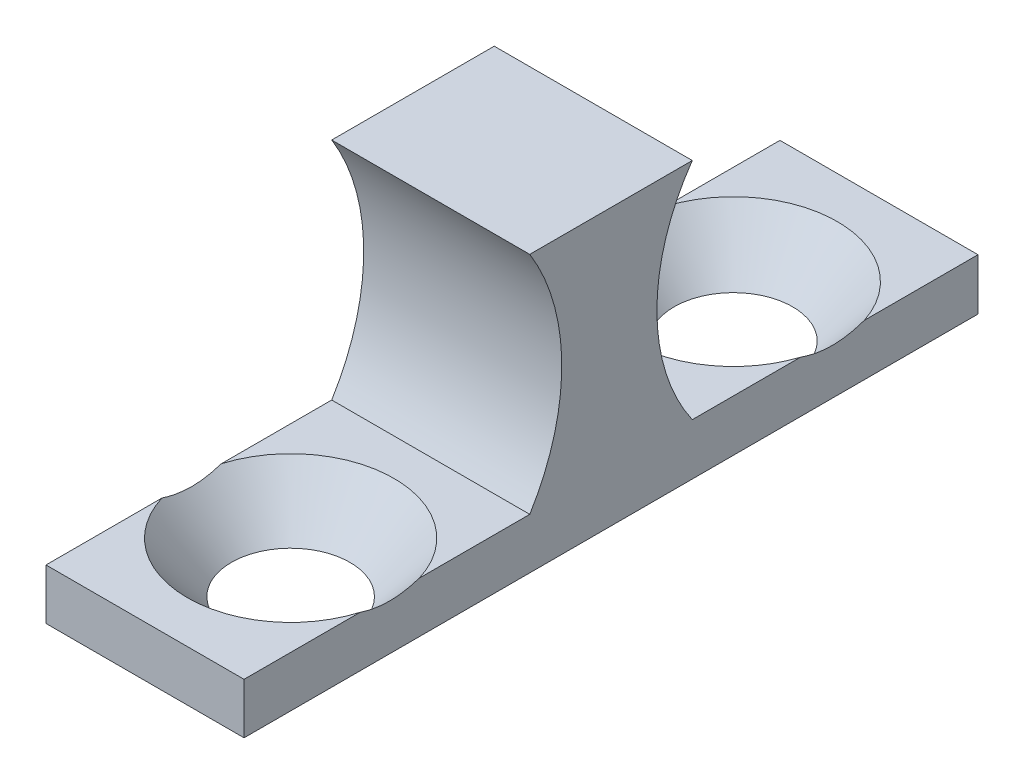
ISO-10303-21;
HEADER;
FILE_DESCRIPTION(('STEP AP214'),'2;1');
FILE_NAME('part.step','',(''),(''),'','','');
FILE_SCHEMA(('AUTOMOTIVE_DESIGN { 1 0 10303 214 1 1 1 1 }'));
ENDSEC;
DATA;
#1=APPLICATION_CONTEXT('core data for automotive mechanical design processes');
#2=APPLICATION_PROTOCOL_DEFINITION('international standard','automotive_design',2000,#1);
#3=PRODUCT_CONTEXT('',#1,'mechanical');
#4=PRODUCT('Part','Part','',(#3));
#5=PRODUCT_RELATED_PRODUCT_CATEGORY('part','',(#4));
#6=PRODUCT_DEFINITION_FORMATION('','',#4);
#7=PRODUCT_DEFINITION_CONTEXT('part definition',#1,'design');
#8=PRODUCT_DEFINITION('design','',#6,#7);
#9=PRODUCT_DEFINITION_SHAPE('','',#8);
#10=(LENGTH_UNIT() NAMED_UNIT(*) SI_UNIT(.MILLI.,.METRE.));
#11=(NAMED_UNIT(*) PLANE_ANGLE_UNIT() SI_UNIT($,.RADIAN.));
#12=(NAMED_UNIT(*) SI_UNIT($,.STERADIAN.) SOLID_ANGLE_UNIT());
#13=UNCERTAINTY_MEASURE_WITH_UNIT(LENGTH_MEASURE(1.E-05),#10,'distance_accuracy_value','');
#14=(GEOMETRIC_REPRESENTATION_CONTEXT(3) GLOBAL_UNCERTAINTY_ASSIGNED_CONTEXT((#13)) GLOBAL_UNIT_ASSIGNED_CONTEXT((#10,
#11,#12)) REPRESENTATION_CONTEXT('',''));
#15=CARTESIAN_POINT('',(0.,0.,0.));
#16=DIRECTION('',(0.,0.,1.));
#17=DIRECTION('',(1.,0.,0.));
#18=AXIS2_PLACEMENT_3D('',#15,#16,#17);
#19=CARTESIAN_POINT('',(6.746875,1.62001456764937,-3.48806378292971));
#20=DIRECTION('',(0.,-1.,0.));
#21=DIRECTION('',(0.,0.,-1.));
#22=AXIS2_PLACEMENT_3D('',#19,#20,#21);
#23=PLANE('',#22);
#24=DIRECTION('',(0.,0.,1.));
#25=VECTOR('',#24,1.);
#26=CARTESIAN_POINT('',(6.746875,1.62001456764937,-3.48806378292971));
#27=LINE('',#26,#25);
#28=CARTESIAN_POINT('',(6.746875,1.62001456764937,-7.17205555422858));
#29=VERTEX_POINT('',#28);
#30=CARTESIAN_POINT('',(6.746875,1.62001456764937,-3.48806378292971));
#31=VERTEX_POINT('',#30);
#32=EDGE_CURVE('E136',#29,#31,#27,.T.);
#33=ORIENTED_EDGE('',*,*,#32,.F.);
#34=CARTESIAN_POINT('',(3.3747601467896,1.62001456764937,-8.26008878292972));
#35=DIRECTION('',(0.,1.,0.));
#36=DIRECTION('',(0.,0.,1.));
#37=AXIS2_PLACEMENT_3D('',#34,#35,#36);
#38=CIRCLE('',#37,3.5433);
#39=CARTESIAN_POINT('',(0.,1.62001456764937,-7.18028841173112));
#40=VERTEX_POINT('',#39);
#41=EDGE_CURVE('E123',#40,#29,#38,.T.);
#42=ORIENTED_EDGE('',*,*,#41,.F.);
#43=DIRECTION('',(0.,0.,1.));
#44=VECTOR('',#43,1.);
#45=CARTESIAN_POINT('',(0.,1.62001456764937,-3.48806378292971));
#46=LINE('',#45,#44);
#47=CARTESIAN_POINT('',(0.,1.62001456764937,-3.48806378292971));
#48=VERTEX_POINT('',#47);
#49=EDGE_CURVE('E167',#40,#48,#46,.T.);
#50=ORIENTED_EDGE('',*,*,#49,.T.);
#51=DIRECTION('',(-1.,0.,0.));
#52=VECTOR('',#51,1.);
#53=CARTESIAN_POINT('',(6.746875,1.62001456764937,-3.48806378292971));
#54=LINE('',#53,#52);
#55=EDGE_CURVE('E144',#31,#48,#54,.T.);
#56=ORIENTED_EDGE('',*,*,#55,.F.);
#57=EDGE_LOOP('',(#33,#42,#50,#56));
#58=FACE_BOUND('',#57,.T.);
#59=ADVANCED_FACE('F32',(#58),#23,.F.);
#60=CARTESIAN_POINT('',(6.746875,1.59461456764937,2.04913621707029));
#61=DIRECTION('',(0.,-1.,0.));
#62=DIRECTION('',(0.,0.,-1.));
#63=AXIS2_PLACEMENT_3D('',#60,#61,#62);
#64=PLANE('',#63);
#65=DIRECTION('',(0.,0.,1.));
#66=VECTOR('',#65,1.);
#67=CARTESIAN_POINT('',(6.746875,1.59461456764937,2.04913621707029));
#68=LINE('',#67,#66);
#69=CARTESIAN_POINT('',(6.746875,1.59461456764937,7.83057214819792));
#70=VERTEX_POINT('',#69);
#71=CARTESIAN_POINT('',(6.746875,1.59461456764937,11.7820987170703));
#72=VERTEX_POINT('',#71);
#73=EDGE_CURVE('E154',#70,#72,#68,.T.);
#74=ORIENTED_EDGE('',*,*,#73,.F.);
#75=CARTESIAN_POINT('',(3.3734375,1.59461456764937,6.82116115907129));
#76=DIRECTION('',(0.,-1.,0.));
#77=DIRECTION('',(0.,0.,-1.));
#78=AXIS2_PLACEMENT_3D('',#75,#76,#77);
#79=CIRCLE('',#78,3.52122011685947);
#80=CARTESIAN_POINT('',(0.,1.59461456764937,7.83057214819791));
#81=VERTEX_POINT('',#80);
#82=EDGE_CURVE('E250',#70,#81,#79,.T.);
#83=ORIENTED_EDGE('',*,*,#82,.T.);
#84=DIRECTION('',(0.,0.,1.));
#85=VECTOR('',#84,1.);
#86=CARTESIAN_POINT('',(0.,1.59461456764937,2.04913621707029));
#87=LINE('',#86,#85);
#88=CARTESIAN_POINT('',(0.,1.59461456764937,11.7820987170703));
#89=VERTEX_POINT('',#88);
#90=EDGE_CURVE('E174',#81,#89,#87,.T.);
#91=ORIENTED_EDGE('',*,*,#90,.T.);
#92=DIRECTION('',(-1.,0.,0.));
#93=VECTOR('',#92,1.);
#94=CARTESIAN_POINT('',(6.746875,1.59461456764937,11.7820987170703));
#95=LINE('',#94,#93);
#96=EDGE_CURVE('E158',#72,#89,#95,.T.);
#97=ORIENTED_EDGE('',*,*,#96,.F.);
#98=EDGE_LOOP('',(#74,#83,#91,#97));
#99=FACE_BOUND('',#98,.T.);
#100=ADVANCED_FACE('F220',(#99),#64,.F.);
#101=CARTESIAN_POINT('',(6.746875,1.59461456764937,11.7820987170703));
#102=DIRECTION('',(0.,0.,-1.));
#103=DIRECTION('',(-1.,0.,0.));
#104=AXIS2_PLACEMENT_3D('',#101,#102,#103);
#105=PLANE('',#104);
#106=DIRECTION('',(0.,-1.,0.));
#107=VECTOR('',#106,1.);
#108=CARTESIAN_POINT('',(0.,1.59461456764937,11.7820987170703));
#109=LINE('',#108,#107);
#110=CARTESIAN_POINT('',(0.,-0.132585432350632,11.7820987170703));
#111=VERTEX_POINT('',#110);
#112=EDGE_CURVE('E159',#89,#111,#109,.T.);
#113=ORIENTED_EDGE('',*,*,#112,.T.);
#114=DIRECTION('',(-1.,0.,0.));
#115=VECTOR('',#114,1.);
#116=CARTESIAN_POINT('',(6.746875,-0.132585432350632,11.7820987170703));
#117=LINE('',#116,#115);
#118=CARTESIAN_POINT('',(6.746875,-0.132585432350632,11.7820987170703));
#119=VERTEX_POINT('',#118);
#120=EDGE_CURVE('E196',#119,#111,#117,.T.);
#121=ORIENTED_EDGE('',*,*,#120,.F.);
#122=DIRECTION('',(0.,-1.,0.));
#123=VECTOR('',#122,1.);
#124=CARTESIAN_POINT('',(6.746875,1.59461456764937,11.7820987170703));
#125=LINE('',#124,#123);
#126=EDGE_CURVE('E178',#72,#119,#125,.T.);
#127=ORIENTED_EDGE('',*,*,#126,.F.);
#128=ORIENTED_EDGE('',*,*,#96,.T.);
#129=EDGE_LOOP('',(#113,#121,#127,#128));
#130=FACE_BOUND('',#129,.T.);
#131=ADVANCED_FACE('F34',(#130),#105,.F.);
#132=CARTESIAN_POINT('',(6.746875,-0.132585432350632,11.7820987170703));
#133=DIRECTION('',(0.,1.,0.));
#134=DIRECTION('',(0.,0.,1.));
#135=AXIS2_PLACEMENT_3D('',#132,#133,#134);
#136=PLANE('',#135);
#137=CARTESIAN_POINT('',(3.3747601467896,-0.132585432350628,-8.26008878292972));
#138=DIRECTION('',(0.,1.,0.));
#139=DIRECTION('',(0.,0.,1.));
#140=AXIS2_PLACEMENT_3D('',#137,#138,#139);
#141=CIRCLE('',#140,2.01978806330328);
#142=CARTESIAN_POINT('',(3.3747601467896,-0.132585432350628,-6.24030071962644));
#143=VERTEX_POINT('',#142);
#144=EDGE_CURVE('E140',#143,#143,#141,.T.);
#145=ORIENTED_EDGE('',*,*,#144,.T.);
#146=EDGE_LOOP('',(#145));
#147=FACE_BOUND('',#146,.T.);
#148=CARTESIAN_POINT('',(3.3734375,-0.132585432350631,6.82116115907129));
#149=DIRECTION('',(0.,1.,0.));
#150=DIRECTION('',(0.,0.,1.));
#151=AXIS2_PLACEMENT_3D('',#148,#149,#150);
#152=CIRCLE('',#151,2.01978806330328);
#153=CARTESIAN_POINT('',(3.3734375,-0.132585432350631,8.84094922237457));
#154=VERTEX_POINT('',#153);
#155=EDGE_CURVE('E259',#154,#154,#152,.T.);
#156=ORIENTED_EDGE('',*,*,#155,.T.);
#157=EDGE_LOOP('',(#156));
#158=FACE_BOUND('',#157,.T.);
#159=DIRECTION('',(0.,0.,-1.));
#160=VECTOR('',#159,1.);
#161=CARTESIAN_POINT('',(0.,-0.132585432350632,11.7820987170703));
#162=LINE('',#161,#160);
#163=CARTESIAN_POINT('',(0.,-0.132585432350627,-13.2210262829297));
#164=VERTEX_POINT('',#163);
#165=EDGE_CURVE('E162',#111,#164,#162,.T.);
#166=ORIENTED_EDGE('',*,*,#165,.T.);
#167=DIRECTION('',(-1.,0.,0.));
#168=VECTOR('',#167,1.);
#169=CARTESIAN_POINT('',(6.746875,-0.132585432350627,-13.2210262829297));
#170=LINE('',#169,#168);
#171=CARTESIAN_POINT('',(6.746875,-0.132585432350627,-13.2210262829297));
#172=VERTEX_POINT('',#171);
#173=EDGE_CURVE('E193',#172,#164,#170,.T.);
#174=ORIENTED_EDGE('',*,*,#173,.F.);
#175=DIRECTION('',(0.,0.,-1.));
#176=VECTOR('',#175,1.);
#177=CARTESIAN_POINT('',(6.746875,-0.132585432350632,11.7820987170703));
#178=LINE('',#177,#176);
#179=EDGE_CURVE('E148',#119,#172,#178,.T.);
#180=ORIENTED_EDGE('',*,*,#179,.F.);
#181=ORIENTED_EDGE('',*,*,#120,.T.);
#182=EDGE_LOOP('',(#166,#174,#180,#181));
#183=FACE_BOUND('',#182,.T.);
#184=ADVANCED_FACE('F230',(#147,#158,#183),#136,.F.);
#185=CARTESIAN_POINT('',(6.746875,1.62001456764937,-13.2210262829297));
#186=DIRECTION('',(0.,0.,1.));
#187=DIRECTION('',(1.,0.,0.));
#188=AXIS2_PLACEMENT_3D('',#185,#186,#187);
#189=PLANE('',#188);
#190=DIRECTION('',(0.,1.,0.));
#191=VECTOR('',#190,1.);
#192=CARTESIAN_POINT('',(0.,1.62001456764937,-13.2210262829297));
#193=LINE('',#192,#191);
#194=CARTESIAN_POINT('',(0.,1.62001456764937,-13.2210262829297));
#195=VERTEX_POINT('',#194);
#196=EDGE_CURVE('E165',#164,#195,#193,.T.);
#197=ORIENTED_EDGE('',*,*,#196,.T.);
#198=DIRECTION('',(-1.,0.,0.));
#199=VECTOR('',#198,1.);
#200=CARTESIAN_POINT('',(6.746875,1.62001456764937,-13.2210262829297));
#201=LINE('',#200,#199);
#202=CARTESIAN_POINT('',(6.746875,1.62001456764937,-13.2210262829297));
#203=VERTEX_POINT('',#202);
#204=EDGE_CURVE('E190',#203,#195,#201,.T.);
#205=ORIENTED_EDGE('',*,*,#204,.F.);
#206=DIRECTION('',(0.,1.,0.));
#207=VECTOR('',#206,1.);
#208=CARTESIAN_POINT('',(6.746875,1.62001456764937,-13.2210262829297));
#209=LINE('',#208,#207);
#210=EDGE_CURVE('E145',#172,#203,#209,.T.);
#211=ORIENTED_EDGE('',*,*,#210,.F.);
#212=ORIENTED_EDGE('',*,*,#173,.T.);
#213=EDGE_LOOP('',(#197,#205,#211,#212));
#214=FACE_BOUND('',#213,.T.);
#215=ADVANCED_FACE('F227',(#214),#189,.F.);
#216=CARTESIAN_POINT('',(0.,1.62001456764937,-9.33988915412831));
#217=VERTEX_POINT('',#216);
#218=EDGE_CURVE('E168',#195,#217,#46,.T.);
#219=ORIENTED_EDGE('',*,*,#218,.T.);
#220=CARTESIAN_POINT('',(6.746875,1.62001456764937,-9.34812201163085));
#221=VERTEX_POINT('',#220);
#222=EDGE_CURVE('E52',#221,#217,#38,.T.);
#223=ORIENTED_EDGE('',*,*,#222,.F.);
#224=EDGE_CURVE('E139',#203,#221,#27,.T.);
#225=ORIENTED_EDGE('',*,*,#224,.F.);
#226=ORIENTED_EDGE('',*,*,#204,.T.);
#227=EDGE_LOOP('',(#219,#223,#225,#226));
#228=FACE_BOUND('',#227,.T.);
#229=ADVANCED_FACE('F223',(#228),#23,.F.);
#230=CARTESIAN_POINT('',(6.746875,9.26541456764937,2.04913621707029));
#231=DIRECTION('',(0.,-1.,0.));
#232=DIRECTION('',(0.,0.,-1.));
#233=AXIS2_PLACEMENT_3D('',#230,#231,#232);
#234=PLANE('',#233);
#235=DIRECTION('',(0.,0.,1.));
#236=VECTOR('',#235,1.);
#237=CARTESIAN_POINT('',(0.,9.26541456764937,2.04913621707029));
#238=LINE('',#237,#236);
#239=CARTESIAN_POINT('',(0.,9.26541456764937,-3.48806378292971));
#240=VERTEX_POINT('',#239);
#241=CARTESIAN_POINT('',(0.,9.26541456764937,2.04913621707029));
#242=VERTEX_POINT('',#241);
#243=EDGE_CURVE('E171',#240,#242,#238,.T.);
#244=ORIENTED_EDGE('',*,*,#243,.T.);
#245=DIRECTION('',(-1.,0.,0.));
#246=VECTOR('',#245,1.);
#247=CARTESIAN_POINT('',(6.746875,9.26541456764937,2.04913621707029));
#248=LINE('',#247,#246);
#249=CARTESIAN_POINT('',(6.746875,9.26541456764937,2.04913621707029));
#250=VERTEX_POINT('',#249);
#251=EDGE_CURVE('E184',#250,#242,#248,.T.);
#252=ORIENTED_EDGE('',*,*,#251,.F.);
#253=DIRECTION('',(0.,0.,1.));
#254=VECTOR('',#253,1.);
#255=CARTESIAN_POINT('',(6.746875,9.26541456764937,2.04913621707029));
#256=LINE('',#255,#254);
#257=CARTESIAN_POINT('',(6.746875,9.26541456764937,-3.48806378292971));
#258=VERTEX_POINT('',#257);
#259=EDGE_CURVE('E147',#258,#250,#256,.T.);
#260=ORIENTED_EDGE('',*,*,#259,.F.);
#261=DIRECTION('',(-1.,0.,0.));
#262=VECTOR('',#261,1.);
#263=CARTESIAN_POINT('',(6.746875,9.26541456764937,-3.48806378292971));
#264=LINE('',#263,#262);
#265=EDGE_CURVE('E186',#258,#240,#264,.T.);
#266=ORIENTED_EDGE('',*,*,#265,.T.);
#267=EDGE_LOOP('',(#244,#252,#260,#266));
#268=FACE_BOUND('',#267,.T.);
#269=ADVANCED_FACE('F218',(#268),#234,.F.);
#270=CARTESIAN_POINT('',(0.,1.59461456764937,2.04913621707029));
#271=VERTEX_POINT('',#270);
#272=CARTESIAN_POINT('',(0.,1.59461456764937,5.81175016994467));
#273=VERTEX_POINT('',#272);
#274=EDGE_CURVE('E175',#271,#273,#87,.T.);
#275=ORIENTED_EDGE('',*,*,#274,.T.);
#276=CARTESIAN_POINT('',(6.746875,1.59461456764937,5.81175016994467));
#277=VERTEX_POINT('',#276);
#278=EDGE_CURVE('E59',#273,#277,#79,.T.);
#279=ORIENTED_EDGE('',*,*,#278,.T.);
#280=CARTESIAN_POINT('',(6.746875,1.59461456764937,2.04913621707029));
#281=VERTEX_POINT('',#280);
#282=EDGE_CURVE('E155',#281,#277,#68,.T.);
#283=ORIENTED_EDGE('',*,*,#282,.F.);
#284=DIRECTION('',(-1.,0.,0.));
#285=VECTOR('',#284,1.);
#286=CARTESIAN_POINT('',(6.746875,1.59461456764937,2.04913621707029));
#287=LINE('',#286,#285);
#288=EDGE_CURVE('E181',#281,#271,#287,.T.);
#289=ORIENTED_EDGE('',*,*,#288,.T.);
#290=EDGE_LOOP('',(#275,#279,#283,#289));
#291=FACE_BOUND('',#290,.T.);
#292=ADVANCED_FACE('F214',(#291),#64,.F.);
#293=CARTESIAN_POINT('',(6.746875,-0.132585432350632,11.7820987170703));
#294=DIRECTION('',(1.,0.,0.));
#295=DIRECTION('',(0.,0.,-1.));
#296=AXIS2_PLACEMENT_3D('',#293,#294,#295);
#297=PLANE('',#296);
#298=CARTESIAN_POINT('',(6.746875,8.80529347971611,-17.4503314735438));
#299=CARTESIAN_POINT('',(6.746875,8.5782944699249,-17.2401187353301));
#300=CARTESIAN_POINT('',(6.746875,8.35170033663404,-17.0294662454643));
#301=CARTESIAN_POINT('',(6.746875,7.89955364162698,-16.6070225321277));
#302=CARTESIAN_POINT('',(6.746875,7.67400113653038,-16.3952312480791));
#303=CARTESIAN_POINT('',(6.746875,7.2235627149841,-15.9696768776528));
#304=CARTESIAN_POINT('',(6.746875,6.99868044634885,-15.7559099253784));
#305=CARTESIAN_POINT('',(6.746875,6.55058757106589,-15.3266440078777));
#306=CARTESIAN_POINT('',(6.746875,6.3273769108029,-15.111145098666));
#307=CARTESIAN_POINT('',(6.746875,5.85994669542772,-14.6553454343971));
#308=CARTESIAN_POINT('',(6.746875,5.61596347456158,-14.4148016504156));
#309=CARTESIAN_POINT('',(6.746875,5.1315859502853,-13.9300686364115));
#310=CARTESIAN_POINT('',(6.746875,4.89119203636479,-13.6858790164333));
#311=CARTESIAN_POINT('',(6.746875,4.41590636463918,-13.1928873790357));
#312=CARTESIAN_POINT('',(6.746875,4.18100671408929,-12.9440930320498));
#313=CARTESIAN_POINT('',(6.746875,3.83451013579855,-12.5655802353347));
#314=CARTESIAN_POINT('',(6.746875,3.71999639779857,-12.4385336271873));
#315=CARTESIAN_POINT('',(6.746875,3.49343147473883,-12.1822670771863));
#316=CARTESIAN_POINT('',(6.746875,3.38138015470765,-12.0530472551409));
#317=CARTESIAN_POINT('',(6.746875,3.18879563817588,-11.8254779402117));
#318=CARTESIAN_POINT('',(6.746875,3.10755918788883,-11.7277241950677));
#319=CARTESIAN_POINT('',(6.746875,2.94719633084315,-11.5304919217871));
#320=CARTESIAN_POINT('',(6.746875,2.8680699772428,-11.4310133503022));
#321=CARTESIAN_POINT('',(6.746875,2.71228265950723,-11.2298668555199));
#322=CARTESIAN_POINT('',(6.746875,2.63562611320907,-11.1281954991716));
#323=CARTESIAN_POINT('',(6.746875,2.48556505390891,-10.9224764490445));
#324=CARTESIAN_POINT('',(6.746875,2.41216039809846,-10.8184288599239));
#325=CARTESIAN_POINT('',(6.746875,2.2708366863422,-10.609585666071));
#326=CARTESIAN_POINT('',(6.746875,2.20283888955101,-10.5048436357423));
#327=CARTESIAN_POINT('',(6.746875,2.07184486377917,-10.2922190057315));
#328=CARTESIAN_POINT('',(6.746875,2.00884980757687,-10.1843356776971));
#329=CARTESIAN_POINT('',(6.746875,1.88947804144596,-9.9653534658724));
#330=CARTESIAN_POINT('',(6.746875,1.83308218110782,-9.85426511454927));
#331=CARTESIAN_POINT('',(6.746875,1.72854107623794,-9.62828347393462));
#332=CARTESIAN_POINT('',(6.746875,1.68039108040982,-9.51339242162583));
#333=CARTESIAN_POINT('',(6.746875,1.60602708295064,-9.31097924776741));
#334=CARTESIAN_POINT('',(6.746875,1.57738989128838,-9.22435045802996));
#335=CARTESIAN_POINT('',(6.746875,1.52668386139929,-9.04916229462519));
#336=CARTESIAN_POINT('',(6.746875,1.50461530086947,-8.96060283950642));
#337=CARTESIAN_POINT('',(6.746875,1.46802995630242,-8.78226337463547));
#338=CARTESIAN_POINT('',(6.746875,1.45348523050896,-8.69248917022493));
#339=CARTESIAN_POINT('',(6.746875,1.43252594752269,-8.51198828026258));
#340=CARTESIAN_POINT('',(6.746875,1.42611095604046,-8.42126164585055));
#341=CARTESIAN_POINT('',(6.746875,1.42168218781769,-8.23660600823231));
#342=CARTESIAN_POINT('',(6.746875,1.42395213556671,-8.14266997013583));
#343=CARTESIAN_POINT('',(6.746875,1.437402604765,-7.95544566204433));
#344=CARTESIAN_POINT('',(6.746875,1.4485835258297,-7.86215742128925));
#345=CARTESIAN_POINT('',(6.746875,1.47930468481829,-7.67662564743437));
#346=CARTESIAN_POINT('',(6.746875,1.4988762374855,-7.5843873701267));
#347=CARTESIAN_POINT('',(6.746875,1.5454526329162,-7.40181947448309));
#348=CARTESIAN_POINT('',(6.746875,1.57245889021874,-7.31149022288658));
#349=CARTESIAN_POINT('',(6.746875,1.64930634223034,-7.08438514576674));
#350=CARTESIAN_POINT('',(6.746875,1.70357322246842,-6.94910880916217));
#351=CARTESIAN_POINT('',(6.746875,1.82367065696105,-6.68381190306825));
#352=CARTESIAN_POINT('',(6.746875,1.88950971677038,-6.55379528654431));
#353=CARTESIAN_POINT('',(6.746875,2.03048853656431,-6.29728675355174));
#354=CARTESIAN_POINT('',(6.746875,2.10571339083271,-6.17084207130616));
#355=CARTESIAN_POINT('',(6.746875,2.22344790439392,-5.98435022458727));
#356=CARTESIAN_POINT('',(6.746875,2.26350171158172,-5.92272569364659));
#357=CARTESIAN_POINT('',(6.746875,2.34504194359707,-5.80043468589655));
#358=CARTESIAN_POINT('',(6.746875,2.38652830218941,-5.73976816498132));
#359=CARTESIAN_POINT('',(6.746875,2.53073472854362,-5.53348677775144));
#360=CARTESIAN_POINT('',(6.746875,2.63648508145149,-5.38998757831237));
#361=CARTESIAN_POINT('',(6.746875,2.85330108865239,-5.10704589476331));
#362=CARTESIAN_POINT('',(6.746875,2.96436819381966,-4.96760453487102));
#363=CARTESIAN_POINT('',(6.746875,3.19056938135355,-4.69187208053567));
#364=CARTESIAN_POINT('',(6.746875,3.30570686830515,-4.55558378894594));
#365=CARTESIAN_POINT('',(6.746875,3.53903299457845,-4.2856377119003));
#366=CARTESIAN_POINT('',(6.746875,3.65722185983866,-4.15198012253284));
#367=CARTESIAN_POINT('',(6.746875,3.89646596092877,-3.88627154253472));
#368=CARTESIAN_POINT('',(6.746875,4.0175309234493,-3.75422933077722));
#369=CARTESIAN_POINT('',(6.746875,4.26157554550281,-3.49192399031221));
#370=CARTESIAN_POINT('',(6.746875,4.384555255957,-3.36166090909282));
#371=CARTESIAN_POINT('',(6.746875,4.75566107181724,-2.97321102406219));
#372=CARTESIAN_POINT('',(6.746875,5.00608471085892,-2.71721995541697));
#373=CARTESIAN_POINT('',(6.746875,5.48378762189585,-2.23682823612251));
#374=CARTESIAN_POINT('',(6.746875,5.71064313610736,-2.01200354500192));
#375=CARTESIAN_POINT('',(6.746875,6.16684394955509,-1.56482833171084));
#376=CARTESIAN_POINT('',(6.746875,6.39618961327608,-1.34247818165467));
#377=CARTESIAN_POINT('',(6.746875,6.85480576021725,-0.901569209611641));
#378=CARTESIAN_POINT('',(6.746875,7.08406074298574,-0.68299423028517));
#379=CARTESIAN_POINT('',(6.746875,7.54397198075259,-0.247413058778019));
#380=CARTESIAN_POINT('',(6.746875,7.77462795288422,-0.0304065680984028));
#381=CARTESIAN_POINT('',(6.746875,8.00581749679492,0.186025113096884));
#382=B_SPLINE_CURVE_WITH_KNOTS('',3,(#298,#299,#300,#301,#302,#303,#304,#305,#306,#307,#308,
#309,#310,#311,#312,#313,#314,#315,#316,#317,#318,#319,#320,#321,#322,#323,#324,#325,#326,#327,
#328,#329,#330,#331,#332,#333,#334,#335,#336,#337,#338,#339,#340,#341,#342,#343,#344,#345,#346,
#347,#348,#349,#350,#351,#352,#353,#354,#355,#356,#357,#358,#359,#360,#361,#362,#363,#364,#365,
#366,#367,#368,#369,#370,#371,#372,#373,#374,#375,#376,#377,#378,#379,#380,#381),.UNSPECIFIED.,
.F.,.F.,(4,2,2,2,2,2,2,2,2,2,2,2,2,2,2,2,2,2,2,2,2,2,2,2,2,2,2,2,2,2,2,2,2,2,2,2,2,2,2,2,2,4),
(0.,0.928151491810156,1.85635285476449,2.78715944639226,3.71793605429625,4.74576960161527,
5.77371388419908,6.80007738984151,7.31317051284845,7.82623544140958,8.20752091889241,
8.58881599279747,8.97075898941092,9.35268519613973,9.7272097361033,10.1018218172014,
10.4753183248262,10.8485988930011,11.1220997797181,11.3956122273818,11.668101486764,
11.9405761891893,12.2220270707884,12.5034905748525,12.7860138028668,13.0685908214059,
13.5050789557358,13.9418892608606,14.3829950675625,14.6034729081599,14.8239405683943,
15.3585147356494,15.8932356223967,16.4284148695881,16.9636338582849,17.5010363484951,
18.0384531549978,19.1127040640705,20.0708523365242,21.0291427968362,21.9793964788107,
22.9294642868667),.UNSPECIFIED.);
#383=EDGE_CURVE('E127',#29,#221,#382,.F.);
#384=ORIENTED_EDGE('',*,*,#383,.F.);
#385=ORIENTED_EDGE('',*,*,#32,.T.);
#386=CARTESIAN_POINT('',(6.746875,5.44271456764937,-8.94190480668875));
#387=DIRECTION('',(1.,0.,0.));
#388=DIRECTION('',(0.,0.,-1.));
#389=AXIS2_PLACEMENT_3D('',#386,#387,#388);
#390=CIRCLE('',#389,6.6601364252121);
#391=EDGE_CURVE('E271',#258,#31,#390,.T.);
#392=ORIENTED_EDGE('',*,*,#391,.F.);
#393=ORIENTED_EDGE('',*,*,#259,.T.);
#394=CARTESIAN_POINT('',(6.746875,5.43001456764937,8.24782766517447));
#395=DIRECTION('',(1.,0.,0.));
#396=DIRECTION('',(0.,0.,1.));
#397=AXIS2_PLACEMENT_3D('',#394,#395,#396);
#398=CIRCLE('',#397,7.28931195853216);
#399=EDGE_CURVE('E163',#281,#250,#398,.T.);
#400=ORIENTED_EDGE('',*,*,#399,.F.);
#401=ORIENTED_EDGE('',*,*,#282,.T.);
#402=CARTESIAN_POINT('',(6.746875,8.80304683912429,-2.36651568359257));
#403=CARTESIAN_POINT('',(6.746875,8.57622536290762,-2.15645061506444));
#404=CARTESIAN_POINT('',(6.746875,8.34980881228729,-1.9459457765807));
#405=CARTESIAN_POINT('',(6.746875,7.89801726564661,-1.52379753551499));
#406=CARTESIAN_POINT('',(6.746875,7.67264232615942,-1.31215407245281));
#407=CARTESIAN_POINT('',(6.746875,7.22256001127815,-0.886896713881173));
#408=CARTESIAN_POINT('',(6.746875,6.99785627932173,-0.673278957471826));
#409=CARTESIAN_POINT('',(6.746875,6.55011997069141,-0.244312083816111));
#410=CARTESIAN_POINT('',(6.746875,6.32708734056093,-0.0289630224129207));
#411=CARTESIAN_POINT('',(6.746875,5.86003213390654,0.426518679804463));
#412=CARTESIAN_POINT('',(6.746875,5.61624577168952,0.666894200333835));
#413=CARTESIAN_POINT('',(6.746875,5.1322596098251,1.15128776136457));
#414=CARTESIAN_POINT('',(6.746875,4.89206019836617,1.39530619047718));
#415=CARTESIAN_POINT('',(6.746875,4.41715811835807,1.88795078957165));
#416=CARTESIAN_POINT('',(6.746875,4.18244757104889,2.13656930357734));
#417=CARTESIAN_POINT('',(6.746875,3.83622691903784,2.51481096632891));
#418=CARTESIAN_POINT('',(6.746875,3.72180383409685,2.64176600508993));
#419=CARTESIAN_POINT('',(6.746875,3.49541639567724,2.89784592896061));
#420=CARTESIAN_POINT('',(6.746875,3.38345190782964,3.02697069480454));
#421=CARTESIAN_POINT('',(6.746875,3.19089591483613,3.25450933328862));
#422=CARTESIAN_POINT('',(6.746875,3.10960492610185,3.35233065656747));
#423=CARTESIAN_POINT('',(6.746875,2.94913531919791,3.54969993746785));
#424=CARTESIAN_POINT('',(6.746875,2.86995675423505,3.64924793847616));
#425=CARTESIAN_POINT('',(6.746875,2.71406776924083,3.8505359552795));
#426=CARTESIAN_POINT('',(6.746875,2.6373617792174,3.95227941341819));
#427=CARTESIAN_POINT('',(6.746875,2.48720592484207,4.15814546471538));
#428=CARTESIAN_POINT('',(6.746875,2.41375591729811,4.26226795294275));
#429=CARTESIAN_POINT('',(6.746875,2.272349974678,4.47125971213282));
#430=CARTESIAN_POINT('',(6.746875,2.20431507257423,4.57607526148501));
#431=CARTESIAN_POINT('',(6.746875,2.07325364775896,4.78885065682315));
#432=CARTESIAN_POINT('',(6.746875,2.01022830126316,4.89681123316047));
#433=CARTESIAN_POINT('',(6.746875,1.8908056393999,5.11595122362807));
#434=CARTESIAN_POINT('',(6.746875,1.83438911186493,5.22712007433172));
#435=CARTESIAN_POINT('',(6.746875,1.729818998247,5.45326666329357));
#436=CARTESIAN_POINT('',(6.746875,1.68166064540965,5.5682421582533));
#437=CARTESIAN_POINT('',(6.746875,1.6073062464608,5.77077580312266));
#438=CARTESIAN_POINT('',(6.746875,1.57868149669123,5.85743924409117));
#439=CARTESIAN_POINT('',(6.746875,1.52800526986985,6.03269631575063));
#440=CARTESIAN_POINT('',(6.746875,1.50595407309893,6.12129002857107));
#441=CARTESIAN_POINT('',(6.746875,1.46940800760027,6.29969690226751));
#442=CARTESIAN_POINT('',(6.746875,1.45488520476982,6.38950426780806));
#443=CARTESIAN_POINT('',(6.746875,1.43397363034841,6.57006940997666));
#444=CARTESIAN_POINT('',(6.746875,1.42758442328177,6.66082713545975));
#445=CARTESIAN_POINT('',(6.746875,1.42321113604351,6.84552096541229));
#446=CARTESIAN_POINT('',(6.746875,1.4255087081455,6.93946396507391));
#447=CARTESIAN_POINT('',(6.746875,1.43901124543214,7.1266999696266));
#448=CARTESIAN_POINT('',(6.746875,1.45021661033198,7.21999294515994));
#449=CARTESIAN_POINT('',(6.746875,1.48098278301326,7.40553288869341));
#450=CARTESIAN_POINT('',(6.746875,1.50057488919702,7.497774596238));
#451=CARTESIAN_POINT('',(6.746875,1.54718839464851,7.68034892024392));
#452=CARTESIAN_POINT('',(6.746875,1.57421120553804,7.77068117044805));
#453=CARTESIAN_POINT('',(6.746875,1.65112704434952,7.99788492597748));
#454=CARTESIAN_POINT('',(6.746875,1.7054533578077,8.133253707008));
#455=CARTESIAN_POINT('',(6.746875,1.82567688612033,8.39873032669468));
#456=CARTESIAN_POINT('',(6.746875,1.89158262245807,8.52883420346506));
#457=CARTESIAN_POINT('',(6.746875,2.03269979646114,8.78551397522631));
#458=CARTESIAN_POINT('',(6.746875,2.1079963600929,8.9120426036809));
#459=CARTESIAN_POINT('',(6.746875,2.2258405227692,9.09865814020067));
#460=CARTESIAN_POINT('',(6.746875,2.2659312136049,9.16032351268111));
#461=CARTESIAN_POINT('',(6.746875,2.34754578935313,9.28269557566565));
#462=CARTESIAN_POINT('',(6.746875,2.38906960794839,9.34340231034127));
#463=CARTESIAN_POINT('',(6.746875,2.53345249515618,9.5498883058934));
#464=CARTESIAN_POINT('',(6.746875,2.63934634739738,9.69354826701633));
#465=CARTESIAN_POINT('',(6.746875,2.85645519934532,9.97680606452093));
#466=CARTESIAN_POINT('',(6.746875,2.96767165222248,10.1164027746354));
#467=CARTESIAN_POINT('',(6.746875,3.19417546284798,10.3924422560809));
#468=CARTESIAN_POINT('',(6.746875,3.3094662293696,10.5288822204813));
#469=CARTESIAN_POINT('',(6.746875,3.54310143930573,10.7991289108102));
#470=CARTESIAN_POINT('',(6.746875,3.66144610881429,10.9329354404737));
#471=CARTESIAN_POINT('',(6.746875,3.90100416390539,11.1989404991548));
#472=CARTESIAN_POINT('',(6.746875,4.02222728280742,11.331130241593));
#473=CARTESIAN_POINT('',(6.746875,4.26658944821912,11.5937291760476));
#474=CARTESIAN_POINT('',(6.746875,4.38972854564931,11.7241383205679));
#475=CARTESIAN_POINT('',(6.746875,4.76131361074566,12.1130245822711));
#476=CARTESIAN_POINT('',(6.746875,5.01205840996573,12.3693043531021));
#477=CARTESIAN_POINT('',(6.746875,5.49036237289423,12.8502315980511));
#478=CARTESIAN_POINT('',(6.746875,5.71749746708324,13.0753034844963));
#479=CARTESIAN_POINT('',(6.746875,6.17425826416221,13.5229720479042));
#480=CARTESIAN_POINT('',(6.746875,6.40388433181434,13.7455683524236));
#481=CARTESIAN_POINT('',(6.746875,6.86305985992533,14.186967311819));
#482=CARTESIAN_POINT('',(6.746875,7.0925938196386,14.4057861260721));
#483=CARTESIAN_POINT('',(6.746875,7.55306326988419,14.8418544415779));
#484=CARTESIAN_POINT('',(6.746875,7.78399847748294,15.0591042414286));
#485=CARTESIAN_POINT('',(6.746875,8.01546733566391,15.2757791015643));
#486=B_SPLINE_CURVE_WITH_KNOTS('',3,(#402,#403,#404,#405,#406,#407,#408,#409,#410,#411,#412,
#413,#414,#415,#416,#417,#418,#419,#420,#421,#422,#423,#424,#425,#426,#427,#428,#429,#430,#431,
#432,#433,#434,#435,#436,#437,#438,#439,#440,#441,#442,#443,#444,#445,#446,#447,#448,#449,#450,
#451,#452,#453,#454,#455,#456,#457,#458,#459,#460,#461,#462,#463,#464,#465,#466,#467,#468,#469,
#470,#471,#472,#473,#474,#475,#476,#477,#478,#479,#480,#481,#482,#483,#484,#485),.UNSPECIFIED.,
.F.,.F.,(4,2,2,2,2,2,2,2,2,2,2,2,2,2,2,2,2,2,2,2,2,2,2,2,2,2,2,2,2,2,2,2,2,2,2,2,2,2,2,2,2,4),
(0.,0.927459709382085,1.8549691787716,2.78507919090104,3.71515932177866,4.74221793552332,
5.76938690606706,6.79497761312989,7.30768464971948,7.82036359538965,8.20190952998825,
8.58346506574132,8.96566998956694,9.34785808801972,9.72262802657359,10.0974857006723,
10.4712250802914,10.8447479998691,11.1183356457448,11.3919349550887,11.6645116737716,
11.9370737979839,12.2185478605718,12.500034554326,12.7825810113964,13.0651811813559,
13.5019924168038,13.9391264654831,14.3805585963086,14.6011994697098,14.8218301467169,
15.3570476814874,15.8924121837663,16.4282357266826,16.9640990534631,17.5021484127669,
18.0402120961907,19.1157558876145,20.075021928992,21.034430387966,21.9857945894165,
22.9369726961619),.UNSPECIFIED.);
#487=EDGE_CURVE('E256',#70,#277,#486,.F.);
#488=ORIENTED_EDGE('',*,*,#487,.F.);
#489=ORIENTED_EDGE('',*,*,#73,.T.);
#490=ORIENTED_EDGE('',*,*,#126,.T.);
#491=ORIENTED_EDGE('',*,*,#179,.T.);
#492=ORIENTED_EDGE('',*,*,#210,.T.);
#493=ORIENTED_EDGE('',*,*,#224,.T.);
#494=EDGE_LOOP('',(#384,#385,#392,#393,#400,#401,#488,#489,#490,#491,#492,#493));
#495=FACE_BOUND('',#494,.T.);
#496=ADVANCED_FACE('F134',(#495),#297,.T.);
#497=CARTESIAN_POINT('',(0.,-0.132585432350632,11.7820987170703));
#498=DIRECTION('',(1.,0.,0.));
#499=DIRECTION('',(0.,0.,-1.));
#500=AXIS2_PLACEMENT_3D('',#497,#498,#499);
#501=PLANE('',#500);
#502=ORIENTED_EDGE('',*,*,#49,.F.);
#503=CARTESIAN_POINT('',(0.,8.8008080919212,-17.4452065957692));
#504=CARTESIAN_POINT('',(0.,8.57416373241112,-17.2352888362931));
#505=CARTESIAN_POINT('',(0.,8.34792434760351,-17.0249312885519));
#506=CARTESIAN_POINT('',(0.,7.89648711581374,-16.6030777979536));
#507=CARTESIAN_POINT('',(0.,7.67128932527877,-16.3915817947134));
#508=CARTESIAN_POINT('',(0.,7.22156227960185,-15.9666207205452));
#509=CARTESIAN_POINT('',(0.,6.99703666353884,-15.753151793694));
#510=CARTESIAN_POINT('',(0.,6.54965608155746,-15.324483229759));
#511=CARTESIAN_POINT('',(0.,6.32680106234038,-15.1092836483481));
#512=CARTESIAN_POINT('',(0.,5.86011997580256,-14.6541191221615));
#513=CARTESIAN_POINT('',(0.,5.61653000323641,-14.413911446447));
#514=CARTESIAN_POINT('',(0.,5.13293427269113,-13.9298564926478));
#515=CARTESIAN_POINT('',(0.,4.89292890160629,-13.6860088272892));
#516=CARTESIAN_POINT('',(0.,4.41840950709485,-13.1937103984364));
#517=CARTESIAN_POINT('',(0.,4.18388761882921,-12.9452672765265));
#518=CARTESIAN_POINT('',(0.,3.83794225512567,-12.5672960604362));
#519=CARTESIAN_POINT('',(0.,3.72360961548246,-12.4404323578348));
#520=CARTESIAN_POINT('',(0.,3.49739926123084,-12.1845385804175));
#521=CARTESIAN_POINT('',(0.,3.38552141285196,-12.0555086243284));
#522=CARTESIAN_POINT('',(0.,3.19299389025124,-11.8280005206853));
#523=CARTESIAN_POINT('',(0.,3.11164848995364,-11.7301117346993));
#524=CARTESIAN_POINT('',(0.,2.95107238568857,-11.5326056787816));
#525=CARTESIAN_POINT('',(0.,2.87184173497653,-11.4329883654248));
#526=CARTESIAN_POINT('',(0.,2.71585133254268,-11.2315590636046));
#527=CARTESIAN_POINT('',(0.,2.63909602299956,-11.1297436235069));
#528=CARTESIAN_POINT('',(0.,2.48884561953513,-10.9237308137508));
#529=CARTESIAN_POINT('',(0.,2.41535038203834,-10.8195335492963));
#530=CARTESIAN_POINT('',(0.,2.27386244613002,-10.6103934726327));
#531=CARTESIAN_POINT('',(0.,2.20579055441334,-10.5055045292503));
#532=CARTESIAN_POINT('',(0.,2.07466195684489,-10.2925786242755));
#533=CARTESIAN_POINT('',(0.,2.01160643064503,-10.1845409303342));
#534=CARTESIAN_POINT('',(0.,1.89213308592327,-9.96524342996302));
#535=CARTESIAN_POINT('',(0.,1.83569599344959,-9.85399421791266));
#536=CARTESIAN_POINT('',(0.,1.73109706319341,-9.62768296719247));
#537=CARTESIAN_POINT('',(0.,1.68293044319698,-9.51262317813132));
#538=CARTESIAN_POINT('',(0.,1.60858572344411,-9.3099692167168));
#539=CARTESIAN_POINT('',(0.,1.579973416448,-9.22327112425916));
#540=CARTESIAN_POINT('',(0.,1.52932699291693,-9.04794514565197));
#541=CARTESIAN_POINT('',(0.,1.50729315924827,-8.95931717669587));
#542=CARTESIAN_POINT('',(0.,1.47078636847463,-8.78084289764683));
#543=CARTESIAN_POINT('',(0.,1.45628548504326,-8.69100237286942));
#544=CARTESIAN_POINT('',(0.,1.43542160819711,-8.5103729827532));
#545=CARTESIAN_POINT('',(0.,1.42905817812864,-8.41958416856295));
#546=CARTESIAN_POINT('',(0.,1.42474033816778,-8.23485210445656));
#547=CARTESIAN_POINT('',(0.,1.42706551325182,-8.14090209753827));
#548=CARTESIAN_POINT('',(0.,1.44062008521977,-7.95365430185168));
#549=CARTESIAN_POINT('',(0.,1.45184988191188,-7.86035654255837));
#550=CARTESIAN_POINT('',(0.,1.48266105523204,-7.67480833064889));
#551=CARTESIAN_POINT('',(0.,1.50227371387939,-7.58256314313115));
#552=CARTESIAN_POINT('',(0.,1.54892433828811,-7.39998229176798));
#553=CARTESIAN_POINT('',(0.,1.57596371276335,-7.30964699369865));
#554=CARTESIAN_POINT('',(0.,1.65294799728472,-7.08234445589108));
#555=CARTESIAN_POINT('',(0.,1.70733379217973,-6.94688317778413));
#556=CARTESIAN_POINT('',(0.,1.8276835142105,-6.68122674295612));
#557=CARTESIAN_POINT('',(0.,1.89365597876093,-6.55103555704798));
#558=CARTESIAN_POINT('',(0.,2.0349116128009,-6.29418444945301));
#559=CARTESIAN_POINT('',(0.,2.11027994002231,-6.16757182667044));
#560=CARTESIAN_POINT('',(0.,2.22823383366784,-5.98083252912291));
#561=CARTESIAN_POINT('',(0.,2.26836143551096,-5.91912629152715));
#562=CARTESIAN_POINT('',(0.,2.35005040984103,-5.79667312639872));
#563=CARTESIAN_POINT('',(0.,2.39161171592863,-5.73592615462888));
#564=CARTESIAN_POINT('',(0.,2.53617127190141,-5.52923533995245));
#565=CARTESIAN_POINT('',(0.,2.64220881015381,-5.38541443542999));
#566=CARTESIAN_POINT('',(0.,2.85961088621373,-5.10184016707483));
#567=CARTESIAN_POINT('',(0.,2.97097687949127,-4.96208793156229));
#568=CARTESIAN_POINT('',(0.,3.19778370180549,-4.68574107616954));
#569=CARTESIAN_POINT('',(0.,3.31322794380764,-4.54914926730194));
#570=CARTESIAN_POINT('',(0.,3.54717263070221,-4.27860162244006));
#571=CARTESIAN_POINT('',(0.,3.66567330184421,-4.14464598288745));
#572=CARTESIAN_POINT('',(0.,3.90554570704684,-3.87834410693837));
#573=CARTESIAN_POINT('',(0.,4.0269271810559,-3.74600666482929));
#574=CARTESIAN_POINT('',(0.,4.2716072875678,-3.48311379897877));
#575=CARTESIAN_POINT('',(0.,4.3949059709904,-3.3525584227413));
#576=CARTESIAN_POINT('',(0.,4.76697088216234,-2.96323527972277));
#577=CARTESIAN_POINT('',(0.,5.01803723947108,-2.70666647082978));
#578=CARTESIAN_POINT('',(0.,5.49694297524649,-2.22520309377022));
#579=CARTESIAN_POINT('',(0.,5.72435797224955,-1.99988374115536));
#580=CARTESIAN_POINT('',(0.,6.18167939798654,-1.55172128513348));
#581=CARTESIAN_POINT('',(0.,6.41158619176001,-1.32887855449897));
#582=CARTESIAN_POINT('',(0.,6.87132174372313,-0.886989064600831));
#583=CARTESIAN_POINT('',(0.,7.10113500088424,-0.667926143935413));
#584=CARTESIAN_POINT('',(0.,7.56216330404876,-0.231370140964144));
#585=CARTESIAN_POINT('',(0.,7.79337806705177,-0.0138767599612216));
#586=CARTESIAN_POINT('',(0.,8.02512655924352,0.203041551332496));
#587=B_SPLINE_CURVE_WITH_KNOTS('',3,(#503,#504,#505,#506,#507,#508,#509,#510,#511,#512,#513,
#514,#515,#516,#517,#518,#519,#520,#521,#522,#523,#524,#525,#526,#527,#528,#529,#530,#531,#532,
#533,#534,#535,#536,#537,#538,#539,#540,#541,#542,#543,#544,#545,#546,#547,#548,#549,#550,#551,
#552,#553,#554,#555,#556,#557,#558,#559,#560,#561,#562,#563,#564,#565,#566,#567,#568,#569,#570,
#571,#572,#573,#574,#575,#576,#577,#578,#579,#580,#581,#582,#583,#584,#585,#586),.UNSPECIFIED.,
.F.,.F.,(4,2,2,2,2,2,2,2,2,2,2,2,2,2,2,2,2,2,2,2,2,2,2,2,2,2,2,2,2,2,2,2,2,2,2,2,2,2,2,2,2,4),
(0.,0.926769581106547,1.85358881166842,2.78300391849958,3.71238924599059,4.73867481272148,
5.76507035978976,6.78989014639108,7.30221203401237,7.81450593366865,8.19631181580126,
8.57812730383988,8.96059364386909,9.34304312309819,9.71805795866478,10.0931607238818,
10.4671424753352,10.8409072466904,11.1145816685369,11.3882678563542,11.6609320545931,
11.9335816211259,12.2150790234832,12.4965890654955,12.7791589078811,13.0617823857222,
13.4989169311767,13.9363749325647,14.3781336018736,14.5989376151796,14.8197314160521,
15.3555930958758,15.8916019916346,16.4280706091356,16.9645790528935,17.5032760626464,
18.0419874043436,19.1188256396503,20.0792107140683,21.0397384361482,21.9922144174297,
22.9445040829248),.UNSPECIFIED.);
#588=EDGE_CURVE('E11',#40,#217,#587,.F.);
#589=ORIENTED_EDGE('',*,*,#588,.T.);
#590=ORIENTED_EDGE('',*,*,#218,.F.);
#591=ORIENTED_EDGE('',*,*,#196,.F.);
#592=ORIENTED_EDGE('',*,*,#165,.F.);
#593=ORIENTED_EDGE('',*,*,#112,.F.);
#594=ORIENTED_EDGE('',*,*,#90,.F.);
#595=CARTESIAN_POINT('',(0.,8.80304683912428,-2.36651568359256));
#596=CARTESIAN_POINT('',(0.,8.57622536290762,-2.15645061506444));
#597=CARTESIAN_POINT('',(0.,8.34980881228729,-1.94594577658069));
#598=CARTESIAN_POINT('',(0.,7.8980172656466,-1.52379753551499));
#599=CARTESIAN_POINT('',(0.,7.67264232615941,-1.31215407245281));
#600=CARTESIAN_POINT('',(0.,7.22256001127814,-0.886896713881169));
#601=CARTESIAN_POINT('',(0.,6.99785627932172,-0.673278957471823));
#602=CARTESIAN_POINT('',(0.,6.55011997069141,-0.244312083816108));
#603=CARTESIAN_POINT('',(0.,6.32708734056093,-0.0289630224129178));
#604=CARTESIAN_POINT('',(0.,5.86003213390653,0.426518679804467));
#605=CARTESIAN_POINT('',(0.,5.61624577168952,0.666894200333839));
#606=CARTESIAN_POINT('',(0.,5.13225960982509,1.15128776136457));
#607=CARTESIAN_POINT('',(0.,4.89206019836617,1.39530619047718));
#608=CARTESIAN_POINT('',(0.,4.41715811835807,1.88795078957166));
#609=CARTESIAN_POINT('',(0.,4.18244757104889,2.13656930357735));
#610=CARTESIAN_POINT('',(0.,3.83622691903784,2.51481096632891));
#611=CARTESIAN_POINT('',(0.,3.72180383409685,2.64176600508993));
#612=CARTESIAN_POINT('',(0.,3.49541639567724,2.89784592896061));
#613=CARTESIAN_POINT('',(0.,3.38345190782964,3.02697069480454));
#614=CARTESIAN_POINT('',(0.,3.19089591483613,3.25450933328862));
#615=CARTESIAN_POINT('',(0.,3.10960492610185,3.35233065656747));
#616=CARTESIAN_POINT('',(0.,2.94913531919791,3.54969993746785));
#617=CARTESIAN_POINT('',(0.,2.86995675423505,3.64924793847616));
#618=CARTESIAN_POINT('',(0.,2.71406776924083,3.8505359552795));
#619=CARTESIAN_POINT('',(0.,2.6373617792174,3.95227941341819));
#620=CARTESIAN_POINT('',(0.,2.48720592484207,4.15814546471538));
#621=CARTESIAN_POINT('',(0.,2.41375591729811,4.26226795294275));
#622=CARTESIAN_POINT('',(0.,2.272349974678,4.47125971213282));
#623=CARTESIAN_POINT('',(0.,2.20431507257423,4.57607526148501));
#624=CARTESIAN_POINT('',(0.,2.07325364775896,4.78885065682315));
#625=CARTESIAN_POINT('',(0.,2.01022830126317,4.89681123316047));
#626=CARTESIAN_POINT('',(0.,1.8908056393999,5.11595122362807));
#627=CARTESIAN_POINT('',(0.,1.83438911186494,5.22712007433172));
#628=CARTESIAN_POINT('',(0.,1.729818998247,5.45326666329356));
#629=CARTESIAN_POINT('',(0.,1.68166064540966,5.5682421582533));
#630=CARTESIAN_POINT('',(0.,1.6073062464608,5.77077580312266));
#631=CARTESIAN_POINT('',(0.,1.57868149669124,5.85743924409117));
#632=CARTESIAN_POINT('',(0.,1.52800526986985,6.03269631575063));
#633=CARTESIAN_POINT('',(0.,1.50595407309893,6.12129002857106));
#634=CARTESIAN_POINT('',(0.,1.46940800760027,6.29969690226751));
#635=CARTESIAN_POINT('',(0.,1.45488520476982,6.38950426780806));
#636=CARTESIAN_POINT('',(0.,1.43397363034841,6.57006940997666));
#637=CARTESIAN_POINT('',(0.,1.42758442328177,6.66082713545975));
#638=CARTESIAN_POINT('',(0.,1.42321113604352,6.84552096541229));
#639=CARTESIAN_POINT('',(0.,1.42550870814551,6.93946396507391));
#640=CARTESIAN_POINT('',(0.,1.43901124543214,7.1266999696266));
#641=CARTESIAN_POINT('',(0.,1.45021661033198,7.21999294515994));
#642=CARTESIAN_POINT('',(0.,1.48098278301326,7.40553288869341));
#643=CARTESIAN_POINT('',(0.,1.50057488919702,7.497774596238));
#644=CARTESIAN_POINT('',(0.,1.54718839464851,7.68034892024392));
#645=CARTESIAN_POINT('',(0.,1.57421120553805,7.77068117044805));
#646=CARTESIAN_POINT('',(0.,1.65112704434953,7.99788492597748));
#647=CARTESIAN_POINT('',(0.,1.7054533578077,8.133253707008));
#648=CARTESIAN_POINT('',(0.,1.82567688612033,8.39873032669468));
#649=CARTESIAN_POINT('',(0.,1.89158262245808,8.52883420346506));
#650=CARTESIAN_POINT('',(0.,2.03269979646114,8.78551397522631));
#651=CARTESIAN_POINT('',(0.,2.1079963600929,8.9120426036809));
#652=CARTESIAN_POINT('',(0.,2.2258405227692,9.09865814020067));
#653=CARTESIAN_POINT('',(0.,2.2659312136049,9.16032351268112));
#654=CARTESIAN_POINT('',(0.,2.34754578935314,9.28269557566566));
#655=CARTESIAN_POINT('',(0.,2.38906960794839,9.34340231034127));
#656=CARTESIAN_POINT('',(0.,2.53345249515618,9.5498883058934));
#657=CARTESIAN_POINT('',(0.,2.63934634739738,9.69354826701633));
#658=CARTESIAN_POINT('',(0.,2.85645519934532,9.97680606452093));
#659=CARTESIAN_POINT('',(0.,2.96767165222248,10.1164027746354));
#660=CARTESIAN_POINT('',(0.,3.19417546284798,10.3924422560809));
#661=CARTESIAN_POINT('',(0.,3.3094662293696,10.5288822204813));
#662=CARTESIAN_POINT('',(0.,3.54310143930574,10.7991289108102));
#663=CARTESIAN_POINT('',(0.,3.6614461088143,10.9329354404737));
#664=CARTESIAN_POINT('',(0.,3.9010041639054,11.1989404991548));
#665=CARTESIAN_POINT('',(0.,4.02222728280742,11.331130241593));
#666=CARTESIAN_POINT('',(0.,4.26658944821913,11.5937291760476));
#667=CARTESIAN_POINT('',(0.,4.38972854564932,11.7241383205679));
#668=CARTESIAN_POINT('',(0.,4.76131361074567,12.1130245822711));
#669=CARTESIAN_POINT('',(0.,5.01205840996574,12.3693043531021));
#670=CARTESIAN_POINT('',(0.,5.49036237289424,12.8502315980511));
#671=CARTESIAN_POINT('',(0.,5.71749746708325,13.0753034844963));
#672=CARTESIAN_POINT('',(0.,6.17425826416222,13.5229720479043));
#673=CARTESIAN_POINT('',(0.,6.40388433181435,13.7455683524236));
#674=CARTESIAN_POINT('',(0.,6.86305985992534,14.1869673118191));
#675=CARTESIAN_POINT('',(0.,7.09259381963861,14.4057861260722));
#676=CARTESIAN_POINT('',(0.,7.55306326988421,14.8418544415779));
#677=CARTESIAN_POINT('',(0.,7.78399847748296,15.0591042414286));
#678=CARTESIAN_POINT('',(0.,8.01546733566392,15.2757791015643));
#679=B_SPLINE_CURVE_WITH_KNOTS('',3,(#595,#596,#597,#598,#599,#600,#601,#602,#603,#604,#605,
#606,#607,#608,#609,#610,#611,#612,#613,#614,#615,#616,#617,#618,#619,#620,#621,#622,#623,#624,
#625,#626,#627,#628,#629,#630,#631,#632,#633,#634,#635,#636,#637,#638,#639,#640,#641,#642,#643,
#644,#645,#646,#647,#648,#649,#650,#651,#652,#653,#654,#655,#656,#657,#658,#659,#660,#661,#662,
#663,#664,#665,#666,#667,#668,#669,#670,#671,#672,#673,#674,#675,#676,#677,#678),.UNSPECIFIED.,
.F.,.F.,(4,2,2,2,2,2,2,2,2,2,2,2,2,2,2,2,2,2,2,2,2,2,2,2,2,2,2,2,2,2,2,2,2,2,2,2,2,2,2,2,2,4),
(0.,0.927459709382084,1.8549691787716,2.78507919090104,3.71515932177866,4.74221793552332,
5.76938690606706,6.79497761312988,7.30768464971947,7.82036359538965,8.20190952998824,
8.58346506574131,8.96566998956693,9.34785808801971,9.72262802657359,10.0974857006723,
10.4712250802914,10.8447479998691,11.1183356457448,11.3919349550887,11.6645116737716,
11.9370737979839,12.2185478605718,12.500034554326,12.7825810113964,13.0651811813559,
13.5019924168037,13.9391264654831,14.3805585963086,14.6011994697098,14.8218301467169,
15.3570476814874,15.8924121837663,16.4282357266826,16.9640990534631,17.5021484127669,
18.0402120961907,19.1157558876145,20.075021928992,21.034430387966,21.9857945894165,
22.9369726961619),.UNSPECIFIED.);
#680=EDGE_CURVE('E45',#81,#273,#679,.F.);
#681=ORIENTED_EDGE('',*,*,#680,.T.);
#682=ORIENTED_EDGE('',*,*,#274,.F.);
#683=CARTESIAN_POINT('',(0.,5.43001456764937,8.24782766517447));
#684=DIRECTION('',(1.,0.,0.));
#685=DIRECTION('',(0.,0.,-1.));
#686=AXIS2_PLACEMENT_3D('',#683,#684,#685);
#687=CIRCLE('',#686,7.28931195853216);
#688=EDGE_CURVE('E273',#242,#271,#687,.F.);
#689=ORIENTED_EDGE('',*,*,#688,.F.);
#690=ORIENTED_EDGE('',*,*,#243,.F.);
#691=CARTESIAN_POINT('',(0.,5.44271456764937,-8.94190480668875));
#692=DIRECTION('',(1.,0.,0.));
#693=DIRECTION('',(0.,0.,-1.));
#694=AXIS2_PLACEMENT_3D('',#691,#692,#693);
#695=CIRCLE('',#694,6.6601364252121);
#696=EDGE_CURVE('E262',#48,#240,#695,.F.);
#697=ORIENTED_EDGE('',*,*,#696,.F.);
#698=EDGE_LOOP('',(#502,#589,#590,#591,#592,#593,#594,#681,#682,#689,#690,#697));
#699=FACE_BOUND('',#698,.T.);
#700=ADVANCED_FACE('F205',(#699),#501,.F.);
#701=CARTESIAN_POINT('',(-0.00100000000000013,5.43001456764937,8.24782766517447));
#702=DIRECTION('',(1.,0.,0.));
#703=DIRECTION('',(0.,0.,-1.));
#704=AXIS2_PLACEMENT_3D('',#701,#702,#703);
#705=CYLINDRICAL_SURFACE('',#704,7.28931195853216);
#706=ORIENTED_EDGE('',*,*,#688,.T.);
#707=ORIENTED_EDGE('',*,*,#288,.F.);
#708=ORIENTED_EDGE('',*,*,#399,.T.);
#709=ORIENTED_EDGE('',*,*,#251,.T.);
#710=EDGE_LOOP('',(#706,#707,#708,#709));
#711=FACE_BOUND('',#710,.T.);
#712=ADVANCED_FACE('F210',(#711),#705,.F.);
#713=CARTESIAN_POINT('',(-0.00100000000000013,5.44271456764937,-8.94190480668875));
#714=DIRECTION('',(1.,0.,0.));
#715=DIRECTION('',(0.,0.,-1.));
#716=AXIS2_PLACEMENT_3D('',#713,#714,#715);
#717=CYLINDRICAL_SURFACE('',#716,6.6601364252121);
#718=ORIENTED_EDGE('',*,*,#696,.T.);
#719=ORIENTED_EDGE('',*,*,#265,.F.);
#720=ORIENTED_EDGE('',*,*,#391,.T.);
#721=ORIENTED_EDGE('',*,*,#55,.T.);
#722=EDGE_LOOP('',(#718,#719,#720,#721));
#723=FACE_BOUND('',#722,.T.);
#724=ADVANCED_FACE('F291',(#723),#717,.F.);
#725=CARTESIAN_POINT('',(3.3734375,1.62001456764937,6.82116115907129));
#726=DIRECTION('',(0.,1.,0.));
#727=DIRECTION('',(0.,0.,1.));
#728=AXIS2_PLACEMENT_3D('',#725,#726,#727);
#729=CONICAL_SURFACE('',#728,3.5433,0.715584993317676);
#730=ORIENTED_EDGE('',*,*,#487,.T.);
#731=ORIENTED_EDGE('',*,*,#278,.F.);
#732=ORIENTED_EDGE('',*,*,#680,.F.);
#733=ORIENTED_EDGE('',*,*,#82,.F.);
#734=EDGE_LOOP('',(#730,#731,#732,#733));
#735=FACE_BOUND('',#734,.T.);
#736=ORIENTED_EDGE('',*,*,#155,.F.);
#737=EDGE_LOOP('',(#736));
#738=FACE_BOUND('',#737,.T.);
#739=ADVANCED_FACE('F202',(#735,#738),#729,.F.);
#740=CARTESIAN_POINT('',(3.3747601467896,1.62001456764937,-8.26008878292972));
#741=DIRECTION('',(0.,1.,0.));
#742=DIRECTION('',(0.,0.,1.));
#743=AXIS2_PLACEMENT_3D('',#740,#741,#742);
#744=CONICAL_SURFACE('',#743,3.5433,0.715584993317676);
#745=ORIENTED_EDGE('',*,*,#383,.T.);
#746=ORIENTED_EDGE('',*,*,#222,.T.);
#747=ORIENTED_EDGE('',*,*,#588,.F.);
#748=ORIENTED_EDGE('',*,*,#41,.T.);
#749=EDGE_LOOP('',(#745,#746,#747,#748));
#750=FACE_BOUND('',#749,.T.);
#751=ORIENTED_EDGE('',*,*,#144,.F.);
#752=EDGE_LOOP('',(#751));
#753=FACE_BOUND('',#752,.T.);
#754=ADVANCED_FACE('F125',(#750,#753),#744,.F.);
#755=CLOSED_SHELL('',(#59,#100,#131,#184,#215,#229,#269,#292,#496,#700,#712,#724,#739,#754));
#756=MANIFOLD_SOLID_BREP('B2',#755);
#757=ADVANCED_BREP_SHAPE_REPRESENTATION('',(#18,#756),#14);
#758=SHAPE_DEFINITION_REPRESENTATION(#9,#757);
ENDSEC;
END-ISO-10303-21;
